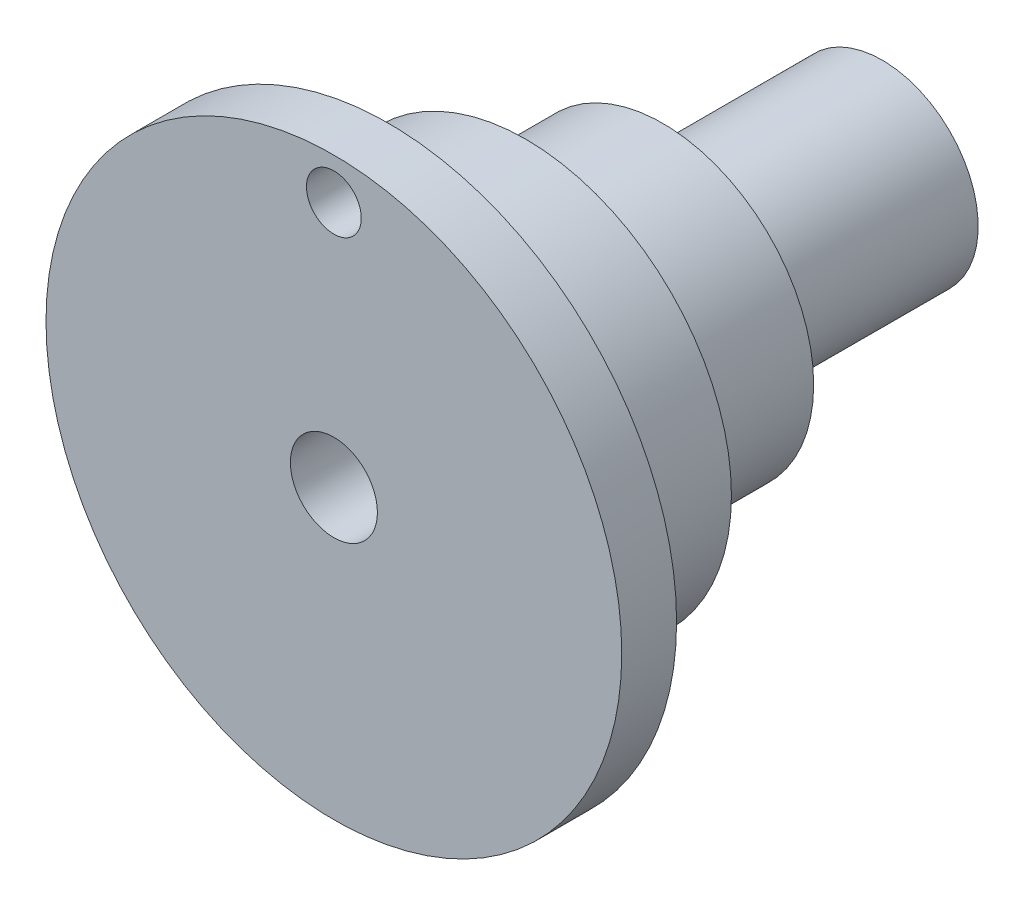
ISO-10303-21;
HEADER;
FILE_DESCRIPTION(('STEP AP214'),'2;1');
FILE_NAME('part.step','',(''),(''),'','','');
FILE_SCHEMA(('AUTOMOTIVE_DESIGN { 1 0 10303 214 1 1 1 1 }'));
ENDSEC;
DATA;
#1=APPLICATION_CONTEXT('core data for automotive mechanical design processes');
#2=APPLICATION_PROTOCOL_DEFINITION('international standard','automotive_design',2000,#1);
#3=PRODUCT_CONTEXT('',#1,'mechanical');
#4=PRODUCT('Part','Part','',(#3));
#5=PRODUCT_RELATED_PRODUCT_CATEGORY('part','',(#4));
#6=PRODUCT_DEFINITION_FORMATION('','',#4);
#7=PRODUCT_DEFINITION_CONTEXT('part definition',#1,'design');
#8=PRODUCT_DEFINITION('design','',#6,#7);
#9=PRODUCT_DEFINITION_SHAPE('','',#8);
#10=(LENGTH_UNIT() NAMED_UNIT(*) SI_UNIT(.MILLI.,.METRE.));
#11=(NAMED_UNIT(*) PLANE_ANGLE_UNIT() SI_UNIT($,.RADIAN.));
#12=(NAMED_UNIT(*) SI_UNIT($,.STERADIAN.) SOLID_ANGLE_UNIT());
#13=UNCERTAINTY_MEASURE_WITH_UNIT(LENGTH_MEASURE(1.E-05),#10,'distance_accuracy_value','');
#14=(GEOMETRIC_REPRESENTATION_CONTEXT(3) GLOBAL_UNCERTAINTY_ASSIGNED_CONTEXT((#13)) GLOBAL_UNIT_ASSIGNED_CONTEXT((#10,
#11,#12)) REPRESENTATION_CONTEXT('',''));
#15=CARTESIAN_POINT('',(0.,0.,0.));
#16=DIRECTION('',(0.,0.,1.));
#17=DIRECTION('',(1.,0.,0.));
#18=AXIS2_PLACEMENT_3D('',#15,#16,#17);
#19=CARTESIAN_POINT('',(0.,0.,0.));
#20=DIRECTION('',(0.,0.,1.));
#21=DIRECTION('',(1.,0.,0.));
#22=AXIS2_PLACEMENT_3D('',#19,#20,#21);
#23=PLANE('',#22);
#24=CARTESIAN_POINT('',(0.,0.,0.));
#25=DIRECTION('',(0.,0.,1.));
#26=DIRECTION('',(1.,0.,0.));
#27=AXIS2_PLACEMENT_3D('',#24,#25,#26);
#28=CIRCLE('',#27,1.5875);
#29=CARTESIAN_POINT('',(1.5875,0.,0.));
#30=VERTEX_POINT('',#29);
#31=EDGE_CURVE('E47',#30,#30,#28,.T.);
#32=ORIENTED_EDGE('',*,*,#31,.T.);
#33=EDGE_LOOP('',(#32));
#34=FACE_BOUND('',#33,.T.);
#35=CARTESIAN_POINT('',(0.,0.,0.));
#36=DIRECTION('',(0.,0.,-1.));
#37=DIRECTION('',(-1.,0.,0.));
#38=AXIS2_PLACEMENT_3D('',#35,#36,#37);
#39=CIRCLE('',#38,3.5);
#40=CARTESIAN_POINT('',(-3.5,0.,0.));
#41=VERTEX_POINT('',#40);
#42=EDGE_CURVE('E79',#41,#41,#39,.T.);
#43=ORIENTED_EDGE('',*,*,#42,.T.);
#44=EDGE_LOOP('',(#43));
#45=FACE_BOUND('',#44,.T.);
#46=ADVANCED_FACE('F43',(#34,#45),#23,.F.);
#47=CARTESIAN_POINT('',(0.,0.,20.));
#48=DIRECTION('',(0.,0.,-1.));
#49=DIRECTION('',(-1.,0.,0.));
#50=AXIS2_PLACEMENT_3D('',#47,#48,#49);
#51=CYLINDRICAL_SURFACE('',#50,7.5);
#52=CARTESIAN_POINT('',(0.,0.,13.));
#53=DIRECTION('',(0.,0.,1.));
#54=DIRECTION('',(1.,0.,0.));
#55=AXIS2_PLACEMENT_3D('',#52,#53,#54);
#56=CIRCLE('',#55,7.5);
#57=CARTESIAN_POINT('',(7.5,0.,13.));
#58=VERTEX_POINT('',#57);
#59=EDGE_CURVE('E70',#58,#58,#56,.F.);
#60=ORIENTED_EDGE('',*,*,#59,.F.);
#61=EDGE_LOOP('',(#60));
#62=FACE_BOUND('',#61,.T.);
#63=CARTESIAN_POINT('',(0.,0.,18.));
#64=DIRECTION('',(0.,0.,1.));
#65=DIRECTION('',(1.,0.,0.));
#66=AXIS2_PLACEMENT_3D('',#63,#64,#65);
#67=CIRCLE('',#66,7.5);
#68=CARTESIAN_POINT('',(7.5,0.,18.));
#69=VERTEX_POINT('',#68);
#70=EDGE_CURVE('E13',#69,#69,#67,.T.);
#71=ORIENTED_EDGE('',*,*,#70,.F.);
#72=EDGE_LOOP('',(#71));
#73=FACE_BOUND('',#72,.T.);
#74=ADVANCED_FACE('F45',(#62,#73),#51,.T.);
#75=CARTESIAN_POINT('',(0.,0.,20.));
#76=DIRECTION('',(0.,0.,1.));
#77=DIRECTION('',(1.,0.,0.));
#78=AXIS2_PLACEMENT_3D('',#75,#76,#77);
#79=PLANE('',#78);
#80=CARTESIAN_POINT('',(0.,9.,20.));
#81=DIRECTION('',(0.,0.,-1.));
#82=DIRECTION('',(-1.,0.,0.));
#83=AXIS2_PLACEMENT_3D('',#80,#81,#82);
#84=CIRCLE('',#83,1.);
#85=CARTESIAN_POINT('',(-1.,9.,20.));
#86=VERTEX_POINT('',#85);
#87=EDGE_CURVE('E61',#86,#86,#84,.T.);
#88=ORIENTED_EDGE('',*,*,#87,.T.);
#89=EDGE_LOOP('',(#88));
#90=FACE_BOUND('',#89,.T.);
#91=CARTESIAN_POINT('',(0.,0.,20.));
#92=DIRECTION('',(0.,0.,1.));
#93=DIRECTION('',(1.,0.,0.));
#94=AXIS2_PLACEMENT_3D('',#91,#92,#93);
#95=CIRCLE('',#94,1.5875);
#96=CARTESIAN_POINT('',(1.5875,0.,20.));
#97=VERTEX_POINT('',#96);
#98=EDGE_CURVE('E51',#97,#97,#95,.T.);
#99=ORIENTED_EDGE('',*,*,#98,.F.);
#100=EDGE_LOOP('',(#99));
#101=FACE_BOUND('',#100,.T.);
#102=CARTESIAN_POINT('',(0.,0.,20.));
#103=DIRECTION('',(0.,0.,1.));
#104=DIRECTION('',(1.,0.,0.));
#105=AXIS2_PLACEMENT_3D('',#102,#103,#104);
#106=CIRCLE('',#105,10.5);
#107=CARTESIAN_POINT('',(10.5,0.,20.));
#108=VERTEX_POINT('',#107);
#109=EDGE_CURVE('E57',#108,#108,#106,.T.);
#110=ORIENTED_EDGE('',*,*,#109,.T.);
#111=EDGE_LOOP('',(#110));
#112=FACE_BOUND('',#111,.T.);
#113=ADVANCED_FACE('F107',(#90,#101,#112),#79,.T.);
#114=CARTESIAN_POINT('',(0.,0.,20.));
#115=DIRECTION('',(0.,0.,-1.));
#116=DIRECTION('',(-1.,0.,0.));
#117=AXIS2_PLACEMENT_3D('',#114,#115,#116);
#118=CYLINDRICAL_SURFACE('',#117,1.5875);
#119=ORIENTED_EDGE('',*,*,#98,.T.);
#120=EDGE_LOOP('',(#119));
#121=FACE_BOUND('',#120,.T.);
#122=ORIENTED_EDGE('',*,*,#31,.F.);
#123=EDGE_LOOP('',(#122));
#124=FACE_BOUND('',#123,.T.);
#125=ADVANCED_FACE('F113',(#121,#124),#118,.F.);
#126=CARTESIAN_POINT('',(0.,0.,18.));
#127=DIRECTION('',(0.,0.,1.));
#128=DIRECTION('',(1.,0.,0.));
#129=AXIS2_PLACEMENT_3D('',#126,#127,#128);
#130=PLANE('',#129);
#131=CARTESIAN_POINT('',(0.,9.,18.));
#132=DIRECTION('',(0.,0.,-1.));
#133=DIRECTION('',(-1.,0.,0.));
#134=AXIS2_PLACEMENT_3D('',#131,#132,#133);
#135=CIRCLE('',#134,1.);
#136=CARTESIAN_POINT('',(-1.,9.,18.));
#137=VERTEX_POINT('',#136);
#138=EDGE_CURVE('E64',#137,#137,#135,.T.);
#139=ORIENTED_EDGE('',*,*,#138,.F.);
#140=EDGE_LOOP('',(#139));
#141=FACE_BOUND('',#140,.T.);
#142=CARTESIAN_POINT('',(0.,0.,18.));
#143=DIRECTION('',(0.,0.,1.));
#144=DIRECTION('',(1.,0.,0.));
#145=AXIS2_PLACEMENT_3D('',#142,#143,#144);
#146=CIRCLE('',#145,10.5);
#147=CARTESIAN_POINT('',(10.5,0.,18.));
#148=VERTEX_POINT('',#147);
#149=EDGE_CURVE('E60',#148,#148,#146,.T.);
#150=ORIENTED_EDGE('',*,*,#149,.F.);
#151=EDGE_LOOP('',(#150));
#152=FACE_BOUND('',#151,.T.);
#153=ORIENTED_EDGE('',*,*,#70,.T.);
#154=EDGE_LOOP('',(#153));
#155=FACE_BOUND('',#154,.T.);
#156=ADVANCED_FACE('F117',(#141,#152,#155),#130,.F.);
#157=CARTESIAN_POINT('',(0.,0.,18.));
#158=DIRECTION('',(0.,0.,1.));
#159=DIRECTION('',(1.,0.,0.));
#160=AXIS2_PLACEMENT_3D('',#157,#158,#159);
#161=CYLINDRICAL_SURFACE('',#160,10.5);
#162=ORIENTED_EDGE('',*,*,#149,.T.);
#163=EDGE_LOOP('',(#162));
#164=FACE_BOUND('',#163,.T.);
#165=ORIENTED_EDGE('',*,*,#109,.F.);
#166=EDGE_LOOP('',(#165));
#167=FACE_BOUND('',#166,.T.);
#168=ADVANCED_FACE('F119',(#164,#167),#161,.T.);
#169=CARTESIAN_POINT('',(0.,9.,20.));
#170=DIRECTION('',(0.,0.,-1.));
#171=DIRECTION('',(-1.,0.,0.));
#172=AXIS2_PLACEMENT_3D('',#169,#170,#171);
#173=CYLINDRICAL_SURFACE('',#172,1.);
#174=ORIENTED_EDGE('',*,*,#87,.F.);
#175=EDGE_LOOP('',(#174));
#176=FACE_BOUND('',#175,.T.);
#177=ORIENTED_EDGE('',*,*,#138,.T.);
#178=EDGE_LOOP('',(#177));
#179=FACE_BOUND('',#178,.T.);
#180=ADVANCED_FACE('F122',(#176,#179),#173,.F.);
#181=CARTESIAN_POINT('',(0.,0.,39.2132034355964));
#182=DIRECTION('',(0.,0.,-1.));
#183=DIRECTION('',(-1.,0.,0.));
#184=AXIS2_PLACEMENT_3D('',#181,#182,#183);
#185=CYLINDRICAL_SURFACE('',#184,5.5);
#186=CARTESIAN_POINT('',(0.,0.,8.));
#187=DIRECTION('',(0.,0.,1.));
#188=DIRECTION('',(1.,0.,0.));
#189=AXIS2_PLACEMENT_3D('',#186,#187,#188);
#190=CIRCLE('',#189,5.5);
#191=CARTESIAN_POINT('',(5.5,0.,8.));
#192=VERTEX_POINT('',#191);
#193=EDGE_CURVE('E76',#192,#192,#190,.F.);
#194=ORIENTED_EDGE('',*,*,#193,.F.);
#195=EDGE_LOOP('',(#194));
#196=FACE_BOUND('',#195,.T.);
#197=CARTESIAN_POINT('',(0.,0.,13.));
#198=DIRECTION('',(0.,0.,1.));
#199=DIRECTION('',(1.,0.,0.));
#200=AXIS2_PLACEMENT_3D('',#197,#198,#199);
#201=CIRCLE('',#200,5.5);
#202=CARTESIAN_POINT('',(5.5,0.,13.));
#203=VERTEX_POINT('',#202);
#204=EDGE_CURVE('E67',#203,#203,#201,.F.);
#205=ORIENTED_EDGE('',*,*,#204,.T.);
#206=EDGE_LOOP('',(#205));
#207=FACE_BOUND('',#206,.T.);
#208=ADVANCED_FACE('F129',(#196,#207),#185,.T.);
#209=CARTESIAN_POINT('',(0.,0.,13.));
#210=DIRECTION('',(0.,0.,1.));
#211=DIRECTION('',(1.,0.,0.));
#212=AXIS2_PLACEMENT_3D('',#209,#210,#211);
#213=PLANE('',#212);
#214=ORIENTED_EDGE('',*,*,#59,.T.);
#215=EDGE_LOOP('',(#214));
#216=FACE_BOUND('',#215,.T.);
#217=ORIENTED_EDGE('',*,*,#204,.F.);
#218=EDGE_LOOP('',(#217));
#219=FACE_BOUND('',#218,.T.);
#220=ADVANCED_FACE('F90',(#216,#219),#213,.F.);
#221=CARTESIAN_POINT('',(0.,0.,28.556349186104));
#222=DIRECTION('',(0.,0.,-1.));
#223=DIRECTION('',(-1.,0.,0.));
#224=AXIS2_PLACEMENT_3D('',#221,#222,#223);
#225=CYLINDRICAL_SURFACE('',#224,3.5);
#226=ORIENTED_EDGE('',*,*,#42,.F.);
#227=EDGE_LOOP('',(#226));
#228=FACE_BOUND('',#227,.T.);
#229=CARTESIAN_POINT('',(0.,0.,8.));
#230=DIRECTION('',(0.,0.,1.));
#231=DIRECTION('',(1.,0.,0.));
#232=AXIS2_PLACEMENT_3D('',#229,#230,#231);
#233=CIRCLE('',#232,3.5);
#234=CARTESIAN_POINT('',(3.5,0.,8.));
#235=VERTEX_POINT('',#234);
#236=EDGE_CURVE('E73',#235,#235,#233,.F.);
#237=ORIENTED_EDGE('',*,*,#236,.T.);
#238=EDGE_LOOP('',(#237));
#239=FACE_BOUND('',#238,.T.);
#240=ADVANCED_FACE('F86',(#228,#239),#225,.T.);
#241=CARTESIAN_POINT('',(0.,0.,8.));
#242=DIRECTION('',(0.,0.,1.));
#243=DIRECTION('',(1.,0.,0.));
#244=AXIS2_PLACEMENT_3D('',#241,#242,#243);
#245=PLANE('',#244);
#246=ORIENTED_EDGE('',*,*,#193,.T.);
#247=EDGE_LOOP('',(#246));
#248=FACE_BOUND('',#247,.T.);
#249=ORIENTED_EDGE('',*,*,#236,.F.);
#250=EDGE_LOOP('',(#249));
#251=FACE_BOUND('',#250,.T.);
#252=ADVANCED_FACE('F89',(#248,#251),#245,.F.);
#253=CLOSED_SHELL('',(#46,#74,#113,#125,#156,#168,#180,#208,#220,#240,#252));
#254=MANIFOLD_SOLID_BREP('B2',#253);
#255=ADVANCED_BREP_SHAPE_REPRESENTATION('',(#18,#254),#14);
#256=SHAPE_DEFINITION_REPRESENTATION(#9,#255);
ENDSEC;
END-ISO-10303-21;
